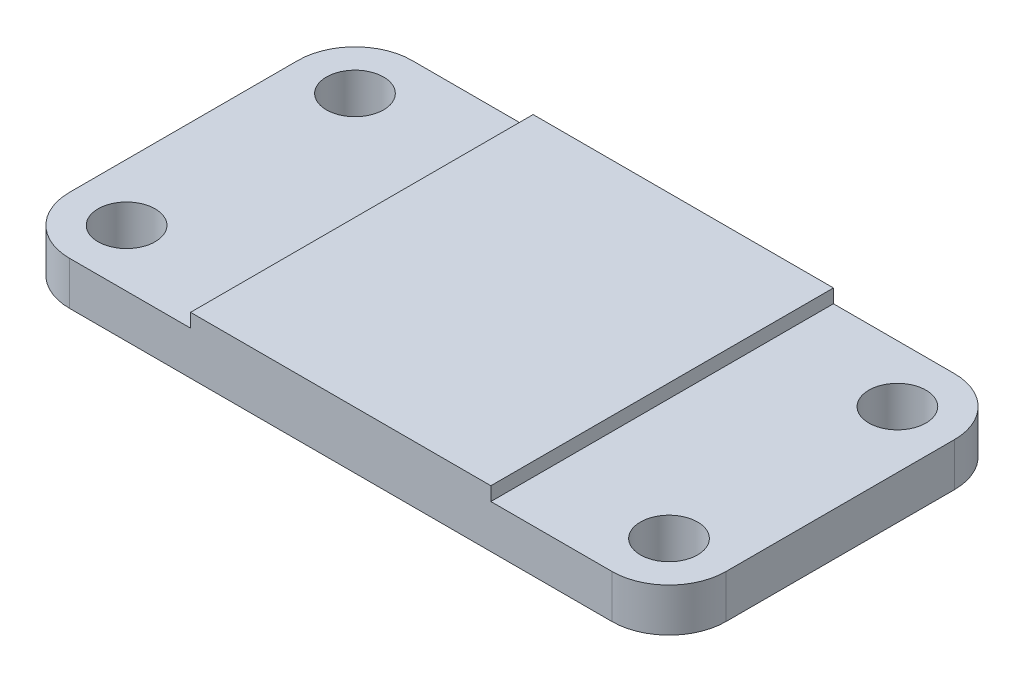
ISO-10303-21;
HEADER;
FILE_DESCRIPTION(('STEP AP214'),'2;1');
FILE_NAME('part.step','',(''),(''),'','','');
FILE_SCHEMA(('AUTOMOTIVE_DESIGN { 1 0 10303 214 1 1 1 1 }'));
ENDSEC;
DATA;
#1=APPLICATION_CONTEXT('core data for automotive mechanical design processes');
#2=APPLICATION_PROTOCOL_DEFINITION('international standard','automotive_design',2000,#1);
#3=PRODUCT_CONTEXT('',#1,'mechanical');
#4=PRODUCT('Part','Part','',(#3));
#5=PRODUCT_RELATED_PRODUCT_CATEGORY('part','',(#4));
#6=PRODUCT_DEFINITION_FORMATION('','',#4);
#7=PRODUCT_DEFINITION_CONTEXT('part definition',#1,'design');
#8=PRODUCT_DEFINITION('design','',#6,#7);
#9=PRODUCT_DEFINITION_SHAPE('','',#8);
#10=(LENGTH_UNIT() NAMED_UNIT(*) SI_UNIT(.MILLI.,.METRE.));
#11=(NAMED_UNIT(*) PLANE_ANGLE_UNIT() SI_UNIT($,.RADIAN.));
#12=(NAMED_UNIT(*) SI_UNIT($,.STERADIAN.) SOLID_ANGLE_UNIT());
#13=UNCERTAINTY_MEASURE_WITH_UNIT(LENGTH_MEASURE(1.E-05),#10,'distance_accuracy_value','');
#14=(GEOMETRIC_REPRESENTATION_CONTEXT(3) GLOBAL_UNCERTAINTY_ASSIGNED_CONTEXT((#13)) GLOBAL_UNIT_ASSIGNED_CONTEXT((#10,
#11,#12)) REPRESENTATION_CONTEXT('',''));
#15=CARTESIAN_POINT('',(0.,0.,0.));
#16=DIRECTION('',(0.,0.,1.));
#17=DIRECTION('',(1.,0.,0.));
#18=AXIS2_PLACEMENT_3D('',#15,#16,#17);
#19=CARTESIAN_POINT('',(0.,9.652,0.));
#20=DIRECTION('',(0.,1.,0.));
#21=DIRECTION('',(0.,0.,1.));
#22=AXIS2_PLACEMENT_3D('',#19,#20,#21);
#23=PLANE('',#22);
#24=CARTESIAN_POINT('',(60.325,9.652,25.4));
#25=DIRECTION('',(0.,1.,0.));
#26=DIRECTION('',(0.,0.,1.));
#27=AXIS2_PLACEMENT_3D('',#24,#25,#26);
#28=CIRCLE('',#27,6.34999999999999);
#29=CARTESIAN_POINT('',(60.325,9.652,31.75));
#30=VERTEX_POINT('',#29);
#31=EDGE_CURVE('E349',#30,#30,#28,.T.);
#32=ORIENTED_EDGE('',*,*,#31,.F.);
#33=EDGE_LOOP('',(#32));
#34=FACE_BOUND('',#33,.T.);
#35=CARTESIAN_POINT('',(60.325,9.652,-25.4));
#36=DIRECTION('',(0.,1.,0.));
#37=DIRECTION('',(0.,0.,1.));
#38=AXIS2_PLACEMENT_3D('',#35,#36,#37);
#39=CIRCLE('',#38,6.34999999999999);
#40=CARTESIAN_POINT('',(60.325,9.652,-19.05));
#41=VERTEX_POINT('',#40);
#42=EDGE_CURVE('E337',#41,#41,#39,.T.);
#43=ORIENTED_EDGE('',*,*,#42,.F.);
#44=EDGE_LOOP('',(#43));
#45=FACE_BOUND('',#44,.T.);
#46=DIRECTION('',(0.,0.,-1.));
#47=VECTOR('',#46,1.);
#48=CARTESIAN_POINT('',(73.025,9.652,-38.1));
#49=LINE('',#48,#47);
#50=CARTESIAN_POINT('',(73.025,9.652,25.4));
#51=VERTEX_POINT('',#50);
#52=CARTESIAN_POINT('',(73.025,9.652,-25.4));
#53=VERTEX_POINT('',#52);
#54=EDGE_CURVE('E175',#51,#53,#49,.T.);
#55=ORIENTED_EDGE('',*,*,#54,.T.);
#56=CARTESIAN_POINT('',(60.325,9.652,-25.4));
#57=DIRECTION('',(0.,1.,0.));
#58=DIRECTION('',(0.,0.,1.));
#59=AXIS2_PLACEMENT_3D('',#56,#57,#58);
#60=CIRCLE('',#59,12.7);
#61=CARTESIAN_POINT('',(60.325,9.652,-38.1));
#62=VERTEX_POINT('',#61);
#63=EDGE_CURVE('E229',#53,#62,#60,.T.);
#64=ORIENTED_EDGE('',*,*,#63,.T.);
#65=DIRECTION('',(-1.,0.,0.));
#66=VECTOR('',#65,1.);
#67=CARTESIAN_POINT('',(-73.025,9.652,-38.1));
#68=LINE('',#67,#66);
#69=CARTESIAN_POINT('',(33.401,9.652,-38.1));
#70=VERTEX_POINT('',#69);
#71=EDGE_CURVE('E181',#62,#70,#68,.T.);
#72=ORIENTED_EDGE('',*,*,#71,.T.);
#73=DIRECTION('',(0.,0.,-1.));
#74=VECTOR('',#73,1.);
#75=CARTESIAN_POINT('',(33.401,9.652,-38.1));
#76=LINE('',#75,#74);
#77=CARTESIAN_POINT('',(33.401,9.652,38.1));
#78=VERTEX_POINT('',#77);
#79=EDGE_CURVE('E160',#78,#70,#76,.T.);
#80=ORIENTED_EDGE('',*,*,#79,.F.);
#81=DIRECTION('',(1.,0.,0.));
#82=VECTOR('',#81,1.);
#83=CARTESIAN_POINT('',(-73.025,9.652,38.1));
#84=LINE('',#83,#82);
#85=CARTESIAN_POINT('',(60.325,9.652,38.1));
#86=VERTEX_POINT('',#85);
#87=EDGE_CURVE('E187',#78,#86,#84,.T.);
#88=ORIENTED_EDGE('',*,*,#87,.T.);
#89=CARTESIAN_POINT('',(60.325,9.652,25.4));
#90=DIRECTION('',(0.,1.,0.));
#91=DIRECTION('',(0.,0.,1.));
#92=AXIS2_PLACEMENT_3D('',#89,#90,#91);
#93=CIRCLE('',#92,12.7);
#94=EDGE_CURVE('E226',#86,#51,#93,.T.);
#95=ORIENTED_EDGE('',*,*,#94,.T.);
#96=EDGE_LOOP('',(#55,#64,#72,#80,#88,#95));
#97=FACE_BOUND('',#96,.T.);
#98=ADVANCED_FACE('F43',(#34,#45,#97),#23,.T.);
#99=CARTESIAN_POINT('',(73.025,9.652,-38.1));
#100=DIRECTION('',(-1.,0.,0.));
#101=DIRECTION('',(0.,0.,1.));
#102=AXIS2_PLACEMENT_3D('',#99,#100,#101);
#103=PLANE('',#102);
#104=DIRECTION('',(0.,0.,-1.));
#105=VECTOR('',#104,1.);
#106=CARTESIAN_POINT('',(73.025,0.,-38.1));
#107=LINE('',#106,#105);
#108=CARTESIAN_POINT('',(73.025,0.,25.4));
#109=VERTEX_POINT('',#108);
#110=CARTESIAN_POINT('',(73.025,0.,-25.4));
#111=VERTEX_POINT('',#110);
#112=EDGE_CURVE('E162',#109,#111,#107,.T.);
#113=ORIENTED_EDGE('',*,*,#112,.T.);
#114=DIRECTION('',(0.,-1.,0.));
#115=VECTOR('',#114,1.);
#116=CARTESIAN_POINT('',(73.025,9.652,-25.4));
#117=LINE('',#116,#115);
#118=EDGE_CURVE('E223',#111,#53,#117,.F.);
#119=ORIENTED_EDGE('',*,*,#118,.T.);
#120=ORIENTED_EDGE('',*,*,#54,.F.);
#121=DIRECTION('',(0.,-1.,0.));
#122=VECTOR('',#121,1.);
#123=CARTESIAN_POINT('',(73.025,9.652,25.4));
#124=LINE('',#123,#122);
#125=EDGE_CURVE('E219',#51,#109,#124,.T.);
#126=ORIENTED_EDGE('',*,*,#125,.T.);
#127=EDGE_LOOP('',(#113,#119,#120,#126));
#128=FACE_BOUND('',#127,.T.);
#129=ADVANCED_FACE('F410',(#128),#103,.F.);
#130=CARTESIAN_POINT('',(-73.025,9.652,-38.1));
#131=DIRECTION('',(0.,0.,1.));
#132=DIRECTION('',(1.,0.,0.));
#133=AXIS2_PLACEMENT_3D('',#130,#131,#132);
#134=PLANE('',#133);
#135=ORIENTED_EDGE('',*,*,#71,.F.);
#136=DIRECTION('',(0.,-1.,0.));
#137=VECTOR('',#136,1.);
#138=CARTESIAN_POINT('',(60.325,9.652,-38.1));
#139=LINE('',#138,#137);
#140=CARTESIAN_POINT('',(60.325,0.,-38.1));
#141=VERTEX_POINT('',#140);
#142=EDGE_CURVE('E203',#62,#141,#139,.T.);
#143=ORIENTED_EDGE('',*,*,#142,.T.);
#144=DIRECTION('',(-1.,0.,0.));
#145=VECTOR('',#144,1.);
#146=CARTESIAN_POINT('',(-73.025,0.,-38.1));
#147=LINE('',#146,#145);
#148=CARTESIAN_POINT('',(-60.325,0.,-38.1));
#149=VERTEX_POINT('',#148);
#150=EDGE_CURVE('E169',#141,#149,#147,.T.);
#151=ORIENTED_EDGE('',*,*,#150,.T.);
#152=DIRECTION('',(0.,-1.,0.));
#153=VECTOR('',#152,1.);
#154=CARTESIAN_POINT('',(-60.325,9.652,-38.1));
#155=LINE('',#154,#153);
#156=CARTESIAN_POINT('',(-60.325,9.652,-38.1));
#157=VERTEX_POINT('',#156);
#158=EDGE_CURVE('E190',#149,#157,#155,.F.);
#159=ORIENTED_EDGE('',*,*,#158,.T.);
#160=CARTESIAN_POINT('',(-33.401,9.652,-38.1));
#161=VERTEX_POINT('',#160);
#162=EDGE_CURVE('E179',#161,#157,#68,.T.);
#163=ORIENTED_EDGE('',*,*,#162,.F.);
#164=DIRECTION('',(0.,-1.,0.));
#165=VECTOR('',#164,1.);
#166=CARTESIAN_POINT('',(-33.401,12.7,-38.1));
#167=LINE('',#166,#165);
#168=CARTESIAN_POINT('',(-33.401,12.7,-38.1));
#169=VERTEX_POINT('',#168);
#170=EDGE_CURVE('E142',#169,#161,#167,.T.);
#171=ORIENTED_EDGE('',*,*,#170,.F.);
#172=DIRECTION('',(-1.,0.,0.));
#173=VECTOR('',#172,1.);
#174=CARTESIAN_POINT('',(-33.401,12.7,-38.1));
#175=LINE('',#174,#173);
#176=CARTESIAN_POINT('',(33.401,12.7,-38.1));
#177=VERTEX_POINT('',#176);
#178=EDGE_CURVE('E133',#177,#169,#175,.T.);
#179=ORIENTED_EDGE('',*,*,#178,.F.);
#180=DIRECTION('',(0.,-1.,0.));
#181=VECTOR('',#180,1.);
#182=CARTESIAN_POINT('',(33.401,12.7,-38.1));
#183=LINE('',#182,#181);
#184=EDGE_CURVE('E138',#177,#70,#183,.T.);
#185=ORIENTED_EDGE('',*,*,#184,.T.);
#186=EDGE_LOOP('',(#135,#143,#151,#159,#163,#171,#179,#185));
#187=FACE_BOUND('',#186,.T.);
#188=ADVANCED_FACE('F136',(#187),#134,.F.);
#189=CARTESIAN_POINT('',(-73.025,9.652,-38.1));
#190=DIRECTION('',(1.,0.,0.));
#191=DIRECTION('',(0.,0.,-1.));
#192=AXIS2_PLACEMENT_3D('',#189,#190,#191);
#193=PLANE('',#192);
#194=DIRECTION('',(0.,0.,1.));
#195=VECTOR('',#194,1.);
#196=CARTESIAN_POINT('',(-73.025,0.,-38.1));
#197=LINE('',#196,#195);
#198=CARTESIAN_POINT('',(-73.025,0.,-25.4));
#199=VERTEX_POINT('',#198);
#200=CARTESIAN_POINT('',(-73.025,0.,25.4));
#201=VERTEX_POINT('',#200);
#202=EDGE_CURVE('E195',#199,#201,#197,.T.);
#203=ORIENTED_EDGE('',*,*,#202,.T.);
#204=DIRECTION('',(0.,-1.,0.));
#205=VECTOR('',#204,1.);
#206=CARTESIAN_POINT('',(-73.025,9.652,25.4));
#207=LINE('',#206,#205);
#208=CARTESIAN_POINT('',(-73.025,9.652,25.4));
#209=VERTEX_POINT('',#208);
#210=EDGE_CURVE('E59',#201,#209,#207,.F.);
#211=ORIENTED_EDGE('',*,*,#210,.T.);
#212=DIRECTION('',(0.,0.,1.));
#213=VECTOR('',#212,1.);
#214=CARTESIAN_POINT('',(-73.025,9.652,-38.1));
#215=LINE('',#214,#213);
#216=CARTESIAN_POINT('',(-73.025,9.652,-25.4));
#217=VERTEX_POINT('',#216);
#218=EDGE_CURVE('E184',#217,#209,#215,.T.);
#219=ORIENTED_EDGE('',*,*,#218,.F.);
#220=DIRECTION('',(0.,-1.,0.));
#221=VECTOR('',#220,1.);
#222=CARTESIAN_POINT('',(-73.025,9.652,-25.4));
#223=LINE('',#222,#221);
#224=EDGE_CURVE('E239',#217,#199,#223,.T.);
#225=ORIENTED_EDGE('',*,*,#224,.T.);
#226=EDGE_LOOP('',(#203,#211,#219,#225));
#227=FACE_BOUND('',#226,.T.);
#228=ADVANCED_FACE('F419',(#227),#193,.F.);
#229=CARTESIAN_POINT('',(-73.025,9.652,38.1));
#230=DIRECTION('',(0.,0.,-1.));
#231=DIRECTION('',(-1.,0.,0.));
#232=AXIS2_PLACEMENT_3D('',#229,#230,#231);
#233=PLANE('',#232);
#234=DIRECTION('',(1.,0.,0.));
#235=VECTOR('',#234,1.);
#236=CARTESIAN_POINT('',(-73.025,0.,38.1));
#237=LINE('',#236,#235);
#238=CARTESIAN_POINT('',(-60.325,0.,38.1));
#239=VERTEX_POINT('',#238);
#240=CARTESIAN_POINT('',(60.325,0.,38.1));
#241=VERTEX_POINT('',#240);
#242=EDGE_CURVE('E180',#239,#241,#237,.T.);
#243=ORIENTED_EDGE('',*,*,#242,.T.);
#244=DIRECTION('',(0.,-1.,0.));
#245=VECTOR('',#244,1.);
#246=CARTESIAN_POINT('',(60.325,9.652,38.1));
#247=LINE('',#246,#245);
#248=EDGE_CURVE('E236',#241,#86,#247,.F.);
#249=ORIENTED_EDGE('',*,*,#248,.T.);
#250=ORIENTED_EDGE('',*,*,#87,.F.);
#251=DIRECTION('',(0.,-1.,0.));
#252=VECTOR('',#251,1.);
#253=CARTESIAN_POINT('',(33.401,12.7,38.1));
#254=LINE('',#253,#252);
#255=CARTESIAN_POINT('',(33.401,12.7,38.1));
#256=VERTEX_POINT('',#255);
#257=EDGE_CURVE('E306',#256,#78,#254,.T.);
#258=ORIENTED_EDGE('',*,*,#257,.F.);
#259=DIRECTION('',(1.,0.,0.));
#260=VECTOR('',#259,1.);
#261=CARTESIAN_POINT('',(-33.401,12.7,38.1));
#262=LINE('',#261,#260);
#263=CARTESIAN_POINT('',(-33.401,12.7,38.1));
#264=VERTEX_POINT('',#263);
#265=EDGE_CURVE('E152',#264,#256,#262,.T.);
#266=ORIENTED_EDGE('',*,*,#265,.F.);
#267=DIRECTION('',(0.,-1.,0.));
#268=VECTOR('',#267,1.);
#269=CARTESIAN_POINT('',(-33.401,12.7,38.1));
#270=LINE('',#269,#268);
#271=CARTESIAN_POINT('',(-33.401,9.652,38.1));
#272=VERTEX_POINT('',#271);
#273=EDGE_CURVE('E171',#264,#272,#270,.T.);
#274=ORIENTED_EDGE('',*,*,#273,.T.);
#275=CARTESIAN_POINT('',(-60.325,9.652,38.1));
#276=VERTEX_POINT('',#275);
#277=EDGE_CURVE('E188',#276,#272,#84,.T.);
#278=ORIENTED_EDGE('',*,*,#277,.F.);
#279=DIRECTION('',(0.,-1.,0.));
#280=VECTOR('',#279,1.);
#281=CARTESIAN_POINT('',(-60.325,9.652,38.1));
#282=LINE('',#281,#280);
#283=EDGE_CURVE('E232',#276,#239,#282,.T.);
#284=ORIENTED_EDGE('',*,*,#283,.T.);
#285=EDGE_LOOP('',(#243,#249,#250,#258,#266,#274,#278,#284));
#286=FACE_BOUND('',#285,.T.);
#287=ADVANCED_FACE('F388',(#286),#233,.F.);
#288=CARTESIAN_POINT('',(-60.325,9.652,-25.4));
#289=DIRECTION('',(0.,1.,0.));
#290=DIRECTION('',(0.,0.,1.));
#291=AXIS2_PLACEMENT_3D('',#288,#289,#290);
#292=CIRCLE('',#291,6.34999999999999);
#293=CARTESIAN_POINT('',(-60.325,9.652,-19.05));
#294=VERTEX_POINT('',#293);
#295=EDGE_CURVE('E373',#294,#294,#292,.T.);
#296=ORIENTED_EDGE('',*,*,#295,.F.);
#297=EDGE_LOOP('',(#296));
#298=FACE_BOUND('',#297,.T.);
#299=CARTESIAN_POINT('',(-60.325,9.652,25.4));
#300=DIRECTION('',(0.,1.,0.));
#301=DIRECTION('',(0.,0.,1.));
#302=AXIS2_PLACEMENT_3D('',#299,#300,#301);
#303=CIRCLE('',#302,6.34999999999999);
#304=CARTESIAN_POINT('',(-60.325,9.652,31.75));
#305=VERTEX_POINT('',#304);
#306=EDGE_CURVE('E361',#305,#305,#303,.T.);
#307=ORIENTED_EDGE('',*,*,#306,.F.);
#308=EDGE_LOOP('',(#307));
#309=FACE_BOUND('',#308,.T.);
#310=ORIENTED_EDGE('',*,*,#218,.T.);
#311=CARTESIAN_POINT('',(-60.325,9.652,25.4));
#312=DIRECTION('',(0.,1.,0.));
#313=DIRECTION('',(0.,0.,1.));
#314=AXIS2_PLACEMENT_3D('',#311,#312,#313);
#315=CIRCLE('',#314,12.7);
#316=EDGE_CURVE('E11',#209,#276,#315,.T.);
#317=ORIENTED_EDGE('',*,*,#316,.T.);
#318=ORIENTED_EDGE('',*,*,#277,.T.);
#319=DIRECTION('',(0.,0.,1.));
#320=VECTOR('',#319,1.);
#321=CARTESIAN_POINT('',(-33.401,9.652,-38.1));
#322=LINE('',#321,#320);
#323=EDGE_CURVE('E157',#161,#272,#322,.T.);
#324=ORIENTED_EDGE('',*,*,#323,.F.);
#325=ORIENTED_EDGE('',*,*,#162,.T.);
#326=CARTESIAN_POINT('',(-60.325,9.652,-25.4));
#327=DIRECTION('',(0.,1.,0.));
#328=DIRECTION('',(0.,0.,1.));
#329=AXIS2_PLACEMENT_3D('',#326,#327,#328);
#330=CIRCLE('',#329,12.7);
#331=EDGE_CURVE('E52',#157,#217,#330,.T.);
#332=ORIENTED_EDGE('',*,*,#331,.T.);
#333=EDGE_LOOP('',(#310,#317,#318,#324,#325,#332));
#334=FACE_BOUND('',#333,.T.);
#335=ADVANCED_FACE('F384',(#298,#309,#334),#23,.T.);
#336=CARTESIAN_POINT('',(0.,0.,0.));
#337=DIRECTION('',(0.,1.,0.));
#338=DIRECTION('',(0.,0.,1.));
#339=AXIS2_PLACEMENT_3D('',#336,#337,#338);
#340=PLANE('',#339);
#341=CARTESIAN_POINT('',(-60.325,0.,-25.4));
#342=DIRECTION('',(0.,1.,0.));
#343=DIRECTION('',(0.,0.,1.));
#344=AXIS2_PLACEMENT_3D('',#341,#342,#343);
#345=CIRCLE('',#344,6.34999999999999);
#346=CARTESIAN_POINT('',(-60.325,0.,-19.05));
#347=VERTEX_POINT('',#346);
#348=EDGE_CURVE('E367',#347,#347,#345,.T.);
#349=ORIENTED_EDGE('',*,*,#348,.T.);
#350=EDGE_LOOP('',(#349));
#351=FACE_BOUND('',#350,.T.);
#352=CARTESIAN_POINT('',(-60.325,0.,25.4));
#353=DIRECTION('',(0.,1.,0.));
#354=DIRECTION('',(0.,0.,1.));
#355=AXIS2_PLACEMENT_3D('',#352,#353,#354);
#356=CIRCLE('',#355,6.34999999999999);
#357=CARTESIAN_POINT('',(-60.325,0.,31.75));
#358=VERTEX_POINT('',#357);
#359=EDGE_CURVE('E355',#358,#358,#356,.T.);
#360=ORIENTED_EDGE('',*,*,#359,.T.);
#361=EDGE_LOOP('',(#360));
#362=FACE_BOUND('',#361,.T.);
#363=CARTESIAN_POINT('',(60.325,0.,25.4));
#364=DIRECTION('',(0.,1.,0.));
#365=DIRECTION('',(0.,0.,1.));
#366=AXIS2_PLACEMENT_3D('',#363,#364,#365);
#367=CIRCLE('',#366,6.34999999999999);
#368=CARTESIAN_POINT('',(60.325,0.,31.75));
#369=VERTEX_POINT('',#368);
#370=EDGE_CURVE('E343',#369,#369,#367,.T.);
#371=ORIENTED_EDGE('',*,*,#370,.T.);
#372=EDGE_LOOP('',(#371));
#373=FACE_BOUND('',#372,.T.);
#374=CARTESIAN_POINT('',(60.325,0.,-25.4));
#375=DIRECTION('',(0.,1.,0.));
#376=DIRECTION('',(0.,0.,1.));
#377=AXIS2_PLACEMENT_3D('',#374,#375,#376);
#378=CIRCLE('',#377,6.34999999999999);
#379=CARTESIAN_POINT('',(60.325,0.,-19.05));
#380=VERTEX_POINT('',#379);
#381=EDGE_CURVE('E331',#380,#380,#378,.T.);
#382=ORIENTED_EDGE('',*,*,#381,.T.);
#383=EDGE_LOOP('',(#382));
#384=FACE_BOUND('',#383,.T.);
#385=ORIENTED_EDGE('',*,*,#150,.F.);
#386=CARTESIAN_POINT('',(60.325,0.,-25.4));
#387=DIRECTION('',(0.,1.,0.));
#388=DIRECTION('',(0.,0.,1.));
#389=AXIS2_PLACEMENT_3D('',#386,#387,#388);
#390=CIRCLE('',#389,12.7);
#391=EDGE_CURVE('E216',#141,#111,#390,.F.);
#392=ORIENTED_EDGE('',*,*,#391,.T.);
#393=ORIENTED_EDGE('',*,*,#112,.F.);
#394=CARTESIAN_POINT('',(60.325,0.,25.4));
#395=DIRECTION('',(0.,1.,0.));
#396=DIRECTION('',(0.,0.,1.));
#397=AXIS2_PLACEMENT_3D('',#394,#395,#396);
#398=CIRCLE('',#397,12.7);
#399=EDGE_CURVE('E213',#109,#241,#398,.F.);
#400=ORIENTED_EDGE('',*,*,#399,.T.);
#401=ORIENTED_EDGE('',*,*,#242,.F.);
#402=CARTESIAN_POINT('',(-60.325,0.,25.4));
#403=DIRECTION('',(0.,1.,0.));
#404=DIRECTION('',(0.,0.,1.));
#405=AXIS2_PLACEMENT_3D('',#402,#403,#404);
#406=CIRCLE('',#405,12.7);
#407=EDGE_CURVE('E210',#239,#201,#406,.F.);
#408=ORIENTED_EDGE('',*,*,#407,.T.);
#409=ORIENTED_EDGE('',*,*,#202,.F.);
#410=CARTESIAN_POINT('',(-60.325,0.,-25.4));
#411=DIRECTION('',(0.,1.,0.));
#412=DIRECTION('',(0.,0.,1.));
#413=AXIS2_PLACEMENT_3D('',#410,#411,#412);
#414=CIRCLE('',#413,12.7);
#415=EDGE_CURVE('E207',#199,#149,#414,.F.);
#416=ORIENTED_EDGE('',*,*,#415,.T.);
#417=EDGE_LOOP('',(#385,#392,#393,#400,#401,#408,#409,#416));
#418=FACE_BOUND('',#417,.T.);
#419=ADVANCED_FACE('F387',(#351,#362,#373,#384,#418),#340,.F.);
#420=CARTESIAN_POINT('',(33.401,12.7,-38.1));
#421=DIRECTION('',(-1.,0.,0.));
#422=DIRECTION('',(0.,0.,1.));
#423=AXIS2_PLACEMENT_3D('',#420,#421,#422);
#424=PLANE('',#423);
#425=ORIENTED_EDGE('',*,*,#79,.T.);
#426=ORIENTED_EDGE('',*,*,#184,.F.);
#427=DIRECTION('',(0.,0.,-1.));
#428=VECTOR('',#427,1.);
#429=CARTESIAN_POINT('',(33.401,12.7,-38.1));
#430=LINE('',#429,#428);
#431=EDGE_CURVE('E147',#256,#177,#430,.T.);
#432=ORIENTED_EDGE('',*,*,#431,.F.);
#433=ORIENTED_EDGE('',*,*,#257,.T.);
#434=EDGE_LOOP('',(#425,#426,#432,#433));
#435=FACE_BOUND('',#434,.T.);
#436=ADVANCED_FACE('F159',(#435),#424,.F.);
#437=CARTESIAN_POINT('',(-33.401,12.7,-38.1));
#438=DIRECTION('',(1.,0.,0.));
#439=DIRECTION('',(0.,0.,-1.));
#440=AXIS2_PLACEMENT_3D('',#437,#438,#439);
#441=PLANE('',#440);
#442=ORIENTED_EDGE('',*,*,#323,.T.);
#443=ORIENTED_EDGE('',*,*,#273,.F.);
#444=DIRECTION('',(0.,0.,1.));
#445=VECTOR('',#444,1.);
#446=CARTESIAN_POINT('',(-33.401,12.7,-38.1));
#447=LINE('',#446,#445);
#448=EDGE_CURVE('E146',#169,#264,#447,.T.);
#449=ORIENTED_EDGE('',*,*,#448,.F.);
#450=ORIENTED_EDGE('',*,*,#170,.T.);
#451=EDGE_LOOP('',(#442,#443,#449,#450));
#452=FACE_BOUND('',#451,.T.);
#453=ADVANCED_FACE('F444',(#452),#441,.F.);
#454=CARTESIAN_POINT('',(0.,12.7,0.));
#455=DIRECTION('',(0.,1.,0.));
#456=DIRECTION('',(0.,0.,1.));
#457=AXIS2_PLACEMENT_3D('',#454,#455,#456);
#458=PLANE('',#457);
#459=ORIENTED_EDGE('',*,*,#431,.T.);
#460=ORIENTED_EDGE('',*,*,#178,.T.);
#461=ORIENTED_EDGE('',*,*,#448,.T.);
#462=ORIENTED_EDGE('',*,*,#265,.T.);
#463=EDGE_LOOP('',(#459,#460,#461,#462));
#464=FACE_BOUND('',#463,.T.);
#465=ADVANCED_FACE('F150',(#464),#458,.T.);
#466=CARTESIAN_POINT('',(60.325,9.652,-25.4));
#467=DIRECTION('',(0.,-1.,0.));
#468=DIRECTION('',(0.,0.,-1.));
#469=AXIS2_PLACEMENT_3D('',#466,#467,#468);
#470=CYLINDRICAL_SURFACE('',#469,12.7);
#471=ORIENTED_EDGE('',*,*,#63,.F.);
#472=ORIENTED_EDGE('',*,*,#118,.F.);
#473=ORIENTED_EDGE('',*,*,#391,.F.);
#474=ORIENTED_EDGE('',*,*,#142,.F.);
#475=EDGE_LOOP('',(#471,#472,#473,#474));
#476=FACE_BOUND('',#475,.T.);
#477=ADVANCED_FACE('F416',(#476),#470,.T.);
#478=CARTESIAN_POINT('',(60.325,9.652,25.4));
#479=DIRECTION('',(0.,-1.,0.));
#480=DIRECTION('',(0.,0.,-1.));
#481=AXIS2_PLACEMENT_3D('',#478,#479,#480);
#482=CYLINDRICAL_SURFACE('',#481,12.7);
#483=ORIENTED_EDGE('',*,*,#94,.F.);
#484=ORIENTED_EDGE('',*,*,#248,.F.);
#485=ORIENTED_EDGE('',*,*,#399,.F.);
#486=ORIENTED_EDGE('',*,*,#125,.F.);
#487=EDGE_LOOP('',(#483,#484,#485,#486));
#488=FACE_BOUND('',#487,.T.);
#489=ADVANCED_FACE('F407',(#488),#482,.T.);
#490=CARTESIAN_POINT('',(-60.325,9.652,25.4));
#491=DIRECTION('',(0.,-1.,0.));
#492=DIRECTION('',(0.,0.,-1.));
#493=AXIS2_PLACEMENT_3D('',#490,#491,#492);
#494=CYLINDRICAL_SURFACE('',#493,12.7);
#495=ORIENTED_EDGE('',*,*,#316,.F.);
#496=ORIENTED_EDGE('',*,*,#210,.F.);
#497=ORIENTED_EDGE('',*,*,#407,.F.);
#498=ORIENTED_EDGE('',*,*,#283,.F.);
#499=EDGE_LOOP('',(#495,#496,#497,#498));
#500=FACE_BOUND('',#499,.T.);
#501=ADVANCED_FACE('F396',(#500),#494,.T.);
#502=CARTESIAN_POINT('',(-60.325,9.652,-25.4));
#503=DIRECTION('',(0.,-1.,0.));
#504=DIRECTION('',(0.,0.,-1.));
#505=AXIS2_PLACEMENT_3D('',#502,#503,#504);
#506=CYLINDRICAL_SURFACE('',#505,12.7);
#507=ORIENTED_EDGE('',*,*,#331,.F.);
#508=ORIENTED_EDGE('',*,*,#158,.F.);
#509=ORIENTED_EDGE('',*,*,#415,.F.);
#510=ORIENTED_EDGE('',*,*,#224,.F.);
#511=EDGE_LOOP('',(#507,#508,#509,#510));
#512=FACE_BOUND('',#511,.T.);
#513=ADVANCED_FACE('F45',(#512),#506,.T.);
#514=CARTESIAN_POINT('',(60.325,9.652,-25.4));
#515=DIRECTION('',(0.,1.,0.));
#516=DIRECTION('',(0.,0.,1.));
#517=AXIS2_PLACEMENT_3D('',#514,#515,#516);
#518=CYLINDRICAL_SURFACE('',#517,6.34999999999999);
#519=ORIENTED_EDGE('',*,*,#381,.F.);
#520=EDGE_LOOP('',(#519));
#521=FACE_BOUND('',#520,.T.);
#522=ORIENTED_EDGE('',*,*,#42,.T.);
#523=EDGE_LOOP('',(#522));
#524=FACE_BOUND('',#523,.T.);
#525=ADVANCED_FACE('F453',(#521,#524),#518,.F.);
#526=CARTESIAN_POINT('',(60.325,9.652,25.4));
#527=DIRECTION('',(0.,1.,0.));
#528=DIRECTION('',(0.,0.,1.));
#529=AXIS2_PLACEMENT_3D('',#526,#527,#528);
#530=CYLINDRICAL_SURFACE('',#529,6.34999999999999);
#531=ORIENTED_EDGE('',*,*,#370,.F.);
#532=EDGE_LOOP('',(#531));
#533=FACE_BOUND('',#532,.T.);
#534=ORIENTED_EDGE('',*,*,#31,.T.);
#535=EDGE_LOOP('',(#534));
#536=FACE_BOUND('',#535,.T.);
#537=ADVANCED_FACE('F456',(#533,#536),#530,.F.);
#538=CARTESIAN_POINT('',(-60.325,9.652,25.4));
#539=DIRECTION('',(0.,1.,0.));
#540=DIRECTION('',(0.,0.,1.));
#541=AXIS2_PLACEMENT_3D('',#538,#539,#540);
#542=CYLINDRICAL_SURFACE('',#541,6.34999999999999);
#543=ORIENTED_EDGE('',*,*,#359,.F.);
#544=EDGE_LOOP('',(#543));
#545=FACE_BOUND('',#544,.T.);
#546=ORIENTED_EDGE('',*,*,#306,.T.);
#547=EDGE_LOOP('',(#546));
#548=FACE_BOUND('',#547,.T.);
#549=ADVANCED_FACE('F463',(#545,#548),#542,.F.);
#550=CARTESIAN_POINT('',(-60.325,9.652,-25.4));
#551=DIRECTION('',(0.,1.,0.));
#552=DIRECTION('',(0.,0.,1.));
#553=AXIS2_PLACEMENT_3D('',#550,#551,#552);
#554=CYLINDRICAL_SURFACE('',#553,6.34999999999999);
#555=ORIENTED_EDGE('',*,*,#348,.F.);
#556=EDGE_LOOP('',(#555));
#557=FACE_BOUND('',#556,.T.);
#558=ORIENTED_EDGE('',*,*,#295,.T.);
#559=EDGE_LOOP('',(#558));
#560=FACE_BOUND('',#559,.T.);
#561=ADVANCED_FACE('F382',(#557,#560),#554,.F.);
#562=CLOSED_SHELL('',(#98,#129,#188,#228,#287,#335,#419,#436,#453,#465,#477,#489,#501,#513,#525,
#537,#549,#561));
#563=MANIFOLD_SOLID_BREP('B2',#562);
#564=ADVANCED_BREP_SHAPE_REPRESENTATION('',(#18,#563),#14);
#565=SHAPE_DEFINITION_REPRESENTATION(#9,#564);
ENDSEC;
END-ISO-10303-21;
